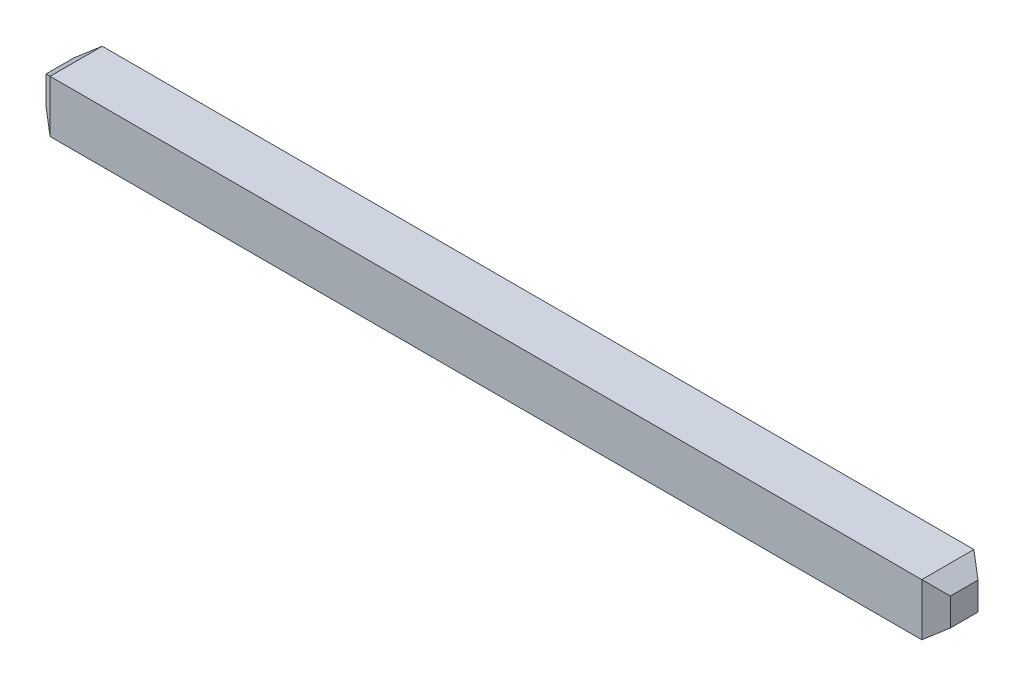
ISO-10303-21;
HEADER;
FILE_DESCRIPTION(('STEP AP214'),'2;1');
FILE_NAME('part.step','',(''),(''),'','','');
FILE_SCHEMA(('AUTOMOTIVE_DESIGN { 1 0 10303 214 1 1 1 1 }'));
ENDSEC;
DATA;
#1=APPLICATION_CONTEXT('core data for automotive mechanical design processes');
#2=APPLICATION_PROTOCOL_DEFINITION('international standard','automotive_design',2000,#1);
#3=PRODUCT_CONTEXT('',#1,'mechanical');
#4=PRODUCT('Part','Part','',(#3));
#5=PRODUCT_RELATED_PRODUCT_CATEGORY('part','',(#4));
#6=PRODUCT_DEFINITION_FORMATION('','',#4);
#7=PRODUCT_DEFINITION_CONTEXT('part definition',#1,'design');
#8=PRODUCT_DEFINITION('design','',#6,#7);
#9=PRODUCT_DEFINITION_SHAPE('','',#8);
#10=(LENGTH_UNIT() NAMED_UNIT(*) SI_UNIT(.MILLI.,.METRE.));
#11=(NAMED_UNIT(*) PLANE_ANGLE_UNIT() SI_UNIT($,.RADIAN.));
#12=(NAMED_UNIT(*) SI_UNIT($,.STERADIAN.) SOLID_ANGLE_UNIT());
#13=UNCERTAINTY_MEASURE_WITH_UNIT(LENGTH_MEASURE(1.E-05),#10,'distance_accuracy_value','');
#14=(GEOMETRIC_REPRESENTATION_CONTEXT(3) GLOBAL_UNCERTAINTY_ASSIGNED_CONTEXT((#13)) GLOBAL_UNIT_ASSIGNED_CONTEXT((#10,
#11,#12)) REPRESENTATION_CONTEXT('',''));
#15=CARTESIAN_POINT('',(0.,0.,0.));
#16=DIRECTION('',(0.,0.,1.));
#17=DIRECTION('',(1.,0.,0.));
#18=AXIS2_PLACEMENT_3D('',#15,#16,#17);
#19=CARTESIAN_POINT('',(-2.4,1.23,-1.515));
#20=DIRECTION('',(0.6,0.,0.8));
#21=DIRECTION('',(0.8,0.,-0.6));
#22=AXIS2_PLACEMENT_3D('',#19,#20,#21);
#23=PLANE('',#22);
#24=DIRECTION('',(0.,1.,0.));
#25=VECTOR('',#24,1.);
#26=CARTESIAN_POINT('',(-2.3,1.23,-1.59));
#27=LINE('',#26,#25);
#28=CARTESIAN_POINT('',(-2.3,1.55,-1.59));
#29=VERTEX_POINT('',#28);
#30=CARTESIAN_POINT('',(-2.30000000000001,0.909999999999898,-1.59));
#31=VERTEX_POINT('',#30);
#32=EDGE_CURVE('E101',#29,#31,#27,.F.);
#33=ORIENTED_EDGE('',*,*,#32,.T.);
#34=DIRECTION('',(-0.685994340569492,0.514495755428341,0.514495755427436));
#35=VECTOR('',#34,1.);
#36=CARTESIAN_POINT('',(-2.30000000000009,0.909999999999786,-1.59));
#37=LINE('',#36,#35);
#38=CARTESIAN_POINT('',(-2.49999999999999,1.06000000000001,-1.44));
#39=VERTEX_POINT('',#38);
#40=EDGE_CURVE('E85',#31,#39,#37,.T.);
#41=ORIENTED_EDGE('',*,*,#40,.T.);
#42=DIRECTION('',(0.,1.,0.));
#43=VECTOR('',#42,1.);
#44=CARTESIAN_POINT('',(-2.5,1.23,-1.44));
#45=LINE('',#44,#43);
#46=CARTESIAN_POINT('',(-2.5,1.4,-1.44));
#47=VERTEX_POINT('',#46);
#48=EDGE_CURVE('E79',#39,#47,#45,.T.);
#49=ORIENTED_EDGE('',*,*,#48,.T.);
#50=DIRECTION('',(-0.685994340570035,-0.514495755427527,0.514495755427527));
#51=VECTOR('',#50,1.);
#52=CARTESIAN_POINT('',(-2.3,1.55,-1.59));
#53=LINE('',#52,#51);
#54=EDGE_CURVE('E20',#29,#47,#53,.T.);
#55=ORIENTED_EDGE('',*,*,#54,.F.);
#56=EDGE_LOOP('',(#33,#41,#49,#55));
#57=FACE_BOUND('',#56,.T.);
#58=ADVANCED_FACE('F17',(#57),#23,.F.);
#59=CARTESIAN_POINT('',(8.5,1.23,-1.515));
#60=DIRECTION('',(-0.6,0.,0.8));
#61=DIRECTION('',(0.8,0.,0.6));
#62=AXIS2_PLACEMENT_3D('',#59,#60,#61);
#63=PLANE('',#62);
#64=DIRECTION('',(0.,1.,0.));
#65=VECTOR('',#64,1.);
#66=CARTESIAN_POINT('',(8.6,1.23,-1.44));
#67=LINE('',#66,#65);
#68=CARTESIAN_POINT('',(8.59999999999998,1.06000000000003,-1.44));
#69=VERTEX_POINT('',#68);
#70=CARTESIAN_POINT('',(8.6,1.4,-1.44));
#71=VERTEX_POINT('',#70);
#72=EDGE_CURVE('E113',#69,#71,#67,.T.);
#73=ORIENTED_EDGE('',*,*,#72,.F.);
#74=DIRECTION('',(-0.685994340569493,-0.514495755428341,-0.514495755427436));
#75=VECTOR('',#74,1.);
#76=CARTESIAN_POINT('',(8.59999999999996,1.06000000000005,-1.44));
#77=LINE('',#76,#75);
#78=CARTESIAN_POINT('',(8.40000000000002,0.909999999999884,-1.59));
#79=VERTEX_POINT('',#78);
#80=EDGE_CURVE('E108',#69,#79,#77,.T.);
#81=ORIENTED_EDGE('',*,*,#80,.T.);
#82=DIRECTION('',(0.,1.,0.));
#83=VECTOR('',#82,1.);
#84=CARTESIAN_POINT('',(8.4,1.23,-1.59));
#85=LINE('',#84,#83);
#86=CARTESIAN_POINT('',(8.4,1.55,-1.59));
#87=VERTEX_POINT('',#86);
#88=EDGE_CURVE('E99',#79,#87,#85,.T.);
#89=ORIENTED_EDGE('',*,*,#88,.T.);
#90=DIRECTION('',(-0.685994340570034,0.514495755427526,-0.514495755427529));
#91=VECTOR('',#90,1.);
#92=CARTESIAN_POINT('',(8.6,1.4,-1.44));
#93=LINE('',#92,#91);
#94=EDGE_CURVE('E116',#71,#87,#93,.T.);
#95=ORIENTED_EDGE('',*,*,#94,.F.);
#96=EDGE_LOOP('',(#73,#81,#89,#95));
#97=FACE_BOUND('',#96,.T.);
#98=ADVANCED_FACE('F214',(#97),#63,.F.);
#99=CARTESIAN_POINT('',(-2.4,1.475,-1.27));
#100=DIRECTION('',(-0.6,0.8,0.));
#101=DIRECTION('',(-0.8,-0.6,0.));
#102=AXIS2_PLACEMENT_3D('',#99,#100,#101);
#103=PLANE('',#102);
#104=DIRECTION('',(-0.685994340569492,-0.514495755427436,-0.514495755428341));
#105=VECTOR('',#104,1.);
#106=CARTESIAN_POINT('',(-2.30000000000004,1.55,-0.94999999999985));
#107=LINE('',#106,#105);
#108=CARTESIAN_POINT('',(-2.3,1.55,-0.949999999999906));
#109=VERTEX_POINT('',#108);
#110=CARTESIAN_POINT('',(-2.49999999999998,1.4,-1.10000000000003));
#111=VERTEX_POINT('',#110);
#112=EDGE_CURVE('E128',#109,#111,#107,.T.);
#113=ORIENTED_EDGE('',*,*,#112,.F.);
#114=DIRECTION('',(0.,0.,1.));
#115=VECTOR('',#114,1.);
#116=CARTESIAN_POINT('',(-2.3,1.55,-1.27));
#117=LINE('',#116,#115);
#118=EDGE_CURVE('E93',#29,#109,#117,.T.);
#119=ORIENTED_EDGE('',*,*,#118,.F.);
#120=ORIENTED_EDGE('',*,*,#54,.T.);
#121=DIRECTION('',(0.,0.,-1.));
#122=VECTOR('',#121,1.);
#123=CARTESIAN_POINT('',(-2.5,1.4,-1.27));
#124=LINE('',#123,#122);
#125=EDGE_CURVE('E87',#47,#111,#124,.F.);
#126=ORIENTED_EDGE('',*,*,#125,.T.);
#127=EDGE_LOOP('',(#113,#119,#120,#126));
#128=FACE_BOUND('',#127,.T.);
#129=ADVANCED_FACE('F90',(#128),#103,.T.);
#130=CARTESIAN_POINT('',(-2.5,1.23,-1.27));
#131=DIRECTION('',(1.,0.,0.));
#132=DIRECTION('',(0.,0.,-1.));
#133=AXIS2_PLACEMENT_3D('',#130,#131,#132);
#134=PLANE('',#133);
#135=DIRECTION('',(0.,1.,0.));
#136=VECTOR('',#135,1.);
#137=CARTESIAN_POINT('',(-2.49999999999991,1.23,-1.10000000000011));
#138=LINE('',#137,#136);
#139=CARTESIAN_POINT('',(-2.49999999999997,1.06000000000001,-1.10000000000003));
#140=VERTEX_POINT('',#139);
#141=EDGE_CURVE('E97',#111,#140,#138,.F.);
#142=ORIENTED_EDGE('',*,*,#141,.F.);
#143=ORIENTED_EDGE('',*,*,#125,.F.);
#144=ORIENTED_EDGE('',*,*,#48,.F.);
#145=DIRECTION('',(0.,0.,1.));
#146=VECTOR('',#145,1.);
#147=CARTESIAN_POINT('',(-2.49999999999996,1.06000000000005,-1.27));
#148=LINE('',#147,#146);
#149=EDGE_CURVE('E105',#39,#140,#148,.T.);
#150=ORIENTED_EDGE('',*,*,#149,.T.);
#151=EDGE_LOOP('',(#142,#143,#144,#150));
#152=FACE_BOUND('',#151,.T.);
#153=ADVANCED_FACE('F95',(#152),#134,.F.);
#154=CARTESIAN_POINT('',(3.05,1.23,-1.59));
#155=DIRECTION('',(0.,0.,1.));
#156=DIRECTION('',(1.,0.,0.));
#157=AXIS2_PLACEMENT_3D('',#154,#155,#156);
#158=PLANE('',#157);
#159=ORIENTED_EDGE('',*,*,#32,.F.);
#160=DIRECTION('',(1.,0.,0.));
#161=VECTOR('',#160,1.);
#162=CARTESIAN_POINT('',(3.05,1.55,-1.59));
#163=LINE('',#162,#161);
#164=EDGE_CURVE('E122',#87,#29,#163,.F.);
#165=ORIENTED_EDGE('',*,*,#164,.F.);
#166=ORIENTED_EDGE('',*,*,#88,.F.);
#167=DIRECTION('',(1.,0.,0.));
#168=VECTOR('',#167,1.);
#169=CARTESIAN_POINT('',(3.05,0.91,-1.59));
#170=LINE('',#169,#168);
#171=EDGE_CURVE('E136',#79,#31,#170,.F.);
#172=ORIENTED_EDGE('',*,*,#171,.T.);
#173=EDGE_LOOP('',(#159,#165,#166,#172));
#174=FACE_BOUND('',#173,.T.);
#175=ADVANCED_FACE('F182',(#174),#158,.F.);
#176=CARTESIAN_POINT('',(-2.4,0.9849999999999,-1.27));
#177=DIRECTION('',(0.600000000000912,0.799999999999316,0.));
#178=DIRECTION('',(-0.799999999999316,0.600000000000912,0.));
#179=AXIS2_PLACEMENT_3D('',#176,#177,#178);
#180=PLANE('',#179);
#181=DIRECTION('',(0.,0.,1.));
#182=VECTOR('',#181,1.);
#183=CARTESIAN_POINT('',(-2.3,0.91,-1.27));
#184=LINE('',#183,#182);
#185=CARTESIAN_POINT('',(-2.30000000000005,0.909999999999856,-0.9499999999999));
#186=VERTEX_POINT('',#185);
#187=EDGE_CURVE('E139',#31,#186,#184,.T.);
#188=ORIENTED_EDGE('',*,*,#187,.T.);
#189=DIRECTION('',(0.685994340569371,-0.514495755427688,0.51449575542825));
#190=VECTOR('',#189,1.);
#191=CARTESIAN_POINT('',(-2.49999999999991,1.06,-1.10000000000011));
#192=LINE('',#191,#190);
#193=EDGE_CURVE('E131',#140,#186,#192,.T.);
#194=ORIENTED_EDGE('',*,*,#193,.F.);
#195=ORIENTED_EDGE('',*,*,#149,.F.);
#196=ORIENTED_EDGE('',*,*,#40,.F.);
#197=EDGE_LOOP('',(#188,#194,#195,#196));
#198=FACE_BOUND('',#197,.T.);
#199=ADVANCED_FACE('F179',(#198),#180,.F.);
#200=CARTESIAN_POINT('',(8.5,0.9849999999999,-1.27));
#201=DIRECTION('',(-0.600000000000912,0.799999999999316,0.));
#202=DIRECTION('',(-0.799999999999316,-0.600000000000912,0.));
#203=AXIS2_PLACEMENT_3D('',#200,#201,#202);
#204=PLANE('',#203);
#205=DIRECTION('',(0.,0.,-1.));
#206=VECTOR('',#205,1.);
#207=CARTESIAN_POINT('',(8.6,1.06,-1.27));
#208=LINE('',#207,#206);
#209=CARTESIAN_POINT('',(8.59999999999996,1.06000000000003,-1.10000000000003));
#210=VERTEX_POINT('',#209);
#211=EDGE_CURVE('E110',#210,#69,#208,.T.);
#212=ORIENTED_EDGE('',*,*,#211,.F.);
#213=DIRECTION('',(0.68599434056937,0.514495755427691,-0.51449575542825));
#214=VECTOR('',#213,1.);
#215=CARTESIAN_POINT('',(8.40000000000004,0.9099999999999,-0.949999999999851));
#216=LINE('',#215,#214);
#217=CARTESIAN_POINT('',(8.40000000000005,0.909999999999868,-0.949999999999906));
#218=VERTEX_POINT('',#217);
#219=EDGE_CURVE('E35',#218,#210,#216,.T.);
#220=ORIENTED_EDGE('',*,*,#219,.F.);
#221=DIRECTION('',(0.,0.,1.));
#222=VECTOR('',#221,1.);
#223=CARTESIAN_POINT('',(8.4,0.91,-1.27));
#224=LINE('',#223,#222);
#225=EDGE_CURVE('E134',#218,#79,#224,.F.);
#226=ORIENTED_EDGE('',*,*,#225,.T.);
#227=ORIENTED_EDGE('',*,*,#80,.F.);
#228=EDGE_LOOP('',(#212,#220,#226,#227));
#229=FACE_BOUND('',#228,.T.);
#230=ADVANCED_FACE('F181',(#229),#204,.F.);
#231=CARTESIAN_POINT('',(8.6,1.23,-1.27));
#232=DIRECTION('',(1.,0.,0.));
#233=DIRECTION('',(0.,0.,-1.));
#234=AXIS2_PLACEMENT_3D('',#231,#232,#233);
#235=PLANE('',#234);
#236=ORIENTED_EDGE('',*,*,#72,.T.);
#237=DIRECTION('',(0.,0.,1.));
#238=VECTOR('',#237,1.);
#239=CARTESIAN_POINT('',(8.6,1.4,-1.27));
#240=LINE('',#239,#238);
#241=CARTESIAN_POINT('',(8.59999999999998,1.4,-1.10000000000003));
#242=VERTEX_POINT('',#241);
#243=EDGE_CURVE('E119',#242,#71,#240,.F.);
#244=ORIENTED_EDGE('',*,*,#243,.F.);
#245=DIRECTION('',(0.,1.,0.));
#246=VECTOR('',#245,1.);
#247=CARTESIAN_POINT('',(8.59999999999991,1.23,-1.10000000000011));
#248=LINE('',#247,#246);
#249=EDGE_CURVE('E142',#210,#242,#248,.T.);
#250=ORIENTED_EDGE('',*,*,#249,.F.);
#251=ORIENTED_EDGE('',*,*,#211,.T.);
#252=EDGE_LOOP('',(#236,#244,#250,#251));
#253=FACE_BOUND('',#252,.T.);
#254=ADVANCED_FACE('F189',(#253),#235,.T.);
#255=CARTESIAN_POINT('',(8.5,1.475,-1.27));
#256=DIRECTION('',(0.6,0.8,0.));
#257=DIRECTION('',(-0.8,0.6,0.));
#258=AXIS2_PLACEMENT_3D('',#255,#256,#257);
#259=PLANE('',#258);
#260=DIRECTION('',(-0.685994340569491,0.514495755427439,0.51449575542834));
#261=VECTOR('',#260,1.);
#262=CARTESIAN_POINT('',(8.59999999999991,1.4,-1.10000000000011));
#263=LINE('',#262,#261);
#264=CARTESIAN_POINT('',(8.40000000000001,1.55,-0.949999999999906));
#265=VERTEX_POINT('',#264);
#266=EDGE_CURVE('E145',#242,#265,#263,.T.);
#267=ORIENTED_EDGE('',*,*,#266,.F.);
#268=ORIENTED_EDGE('',*,*,#243,.T.);
#269=ORIENTED_EDGE('',*,*,#94,.T.);
#270=DIRECTION('',(0.,0.,1.));
#271=VECTOR('',#270,1.);
#272=CARTESIAN_POINT('',(8.4,1.55,-1.27));
#273=LINE('',#272,#271);
#274=EDGE_CURVE('E125',#265,#87,#273,.F.);
#275=ORIENTED_EDGE('',*,*,#274,.F.);
#276=EDGE_LOOP('',(#267,#268,#269,#275));
#277=FACE_BOUND('',#276,.T.);
#278=ADVANCED_FACE('F170',(#277),#259,.T.);
#279=CARTESIAN_POINT('',(3.05,1.55,-1.27));
#280=DIRECTION('',(0.,1.,0.));
#281=DIRECTION('',(0.,0.,1.));
#282=AXIS2_PLACEMENT_3D('',#279,#280,#281);
#283=PLANE('',#282);
#284=DIRECTION('',(1.,0.,0.));
#285=VECTOR('',#284,1.);
#286=CARTESIAN_POINT('',(3.05,1.55,-0.95));
#287=LINE('',#286,#285);
#288=EDGE_CURVE('E148',#265,#109,#287,.F.);
#289=ORIENTED_EDGE('',*,*,#288,.F.);
#290=ORIENTED_EDGE('',*,*,#274,.T.);
#291=ORIENTED_EDGE('',*,*,#164,.T.);
#292=ORIENTED_EDGE('',*,*,#118,.T.);
#293=EDGE_LOOP('',(#289,#290,#291,#292));
#294=FACE_BOUND('',#293,.T.);
#295=ADVANCED_FACE('F173',(#294),#283,.T.);
#296=CARTESIAN_POINT('',(-2.4,1.23,-1.025));
#297=DIRECTION('',(-0.600000000000912,0.,0.799999999999316));
#298=DIRECTION('',(0.799999999999316,0.,0.600000000000912));
#299=AXIS2_PLACEMENT_3D('',#296,#297,#298);
#300=PLANE('',#299);
#301=ORIENTED_EDGE('',*,*,#193,.T.);
#302=DIRECTION('',(0.,1.,0.));
#303=VECTOR('',#302,1.);
#304=CARTESIAN_POINT('',(-2.3,1.23,-0.95));
#305=LINE('',#304,#303);
#306=EDGE_CURVE('E151',#109,#186,#305,.F.);
#307=ORIENTED_EDGE('',*,*,#306,.F.);
#308=ORIENTED_EDGE('',*,*,#112,.T.);
#309=ORIENTED_EDGE('',*,*,#141,.T.);
#310=EDGE_LOOP('',(#301,#307,#308,#309));
#311=FACE_BOUND('',#310,.T.);
#312=ADVANCED_FACE('F176',(#311),#300,.T.);
#313=CARTESIAN_POINT('',(3.05,0.91,-1.27));
#314=DIRECTION('',(0.,1.,0.));
#315=DIRECTION('',(0.,0.,1.));
#316=AXIS2_PLACEMENT_3D('',#313,#314,#315);
#317=PLANE('',#316);
#318=ORIENTED_EDGE('',*,*,#187,.F.);
#319=ORIENTED_EDGE('',*,*,#171,.F.);
#320=ORIENTED_EDGE('',*,*,#225,.F.);
#321=DIRECTION('',(1.,0.,0.));
#322=VECTOR('',#321,1.);
#323=CARTESIAN_POINT('',(3.05,0.9099999999999,-0.95));
#324=LINE('',#323,#322);
#325=EDGE_CURVE('E26',#186,#218,#324,.T.);
#326=ORIENTED_EDGE('',*,*,#325,.F.);
#327=EDGE_LOOP('',(#318,#319,#320,#326));
#328=FACE_BOUND('',#327,.T.);
#329=ADVANCED_FACE('F162',(#328),#317,.F.);
#330=CARTESIAN_POINT('',(8.5,1.23,-1.025));
#331=DIRECTION('',(0.600000000000912,0.,0.799999999999316));
#332=DIRECTION('',(0.799999999999316,0.,-0.600000000000912));
#333=AXIS2_PLACEMENT_3D('',#330,#331,#332);
#334=PLANE('',#333);
#335=ORIENTED_EDGE('',*,*,#266,.T.);
#336=DIRECTION('',(0.,1.,0.));
#337=VECTOR('',#336,1.);
#338=CARTESIAN_POINT('',(8.4,1.23,-0.95));
#339=LINE('',#338,#337);
#340=EDGE_CURVE('E11',#218,#265,#339,.T.);
#341=ORIENTED_EDGE('',*,*,#340,.F.);
#342=ORIENTED_EDGE('',*,*,#219,.T.);
#343=ORIENTED_EDGE('',*,*,#249,.T.);
#344=EDGE_LOOP('',(#335,#341,#342,#343));
#345=FACE_BOUND('',#344,.T.);
#346=ADVANCED_FACE('F166',(#345),#334,.T.);
#347=CARTESIAN_POINT('',(3.05,1.23,-0.95));
#348=DIRECTION('',(0.,0.,1.));
#349=DIRECTION('',(1.,0.,0.));
#350=AXIS2_PLACEMENT_3D('',#347,#348,#349);
#351=PLANE('',#350);
#352=ORIENTED_EDGE('',*,*,#325,.T.);
#353=ORIENTED_EDGE('',*,*,#340,.T.);
#354=ORIENTED_EDGE('',*,*,#288,.T.);
#355=ORIENTED_EDGE('',*,*,#306,.T.);
#356=EDGE_LOOP('',(#352,#353,#354,#355));
#357=FACE_BOUND('',#356,.T.);
#358=ADVANCED_FACE('F157',(#357),#351,.T.);
#359=CLOSED_SHELL('',(#58,#98,#129,#153,#175,#199,#230,#254,#278,#295,#312,#329,#346,#358));
#360=MANIFOLD_SOLID_BREP('B1',#359);
#361=ADVANCED_BREP_SHAPE_REPRESENTATION('',(#18,#360),#14);
#362=SHAPE_DEFINITION_REPRESENTATION(#9,#361);
ENDSEC;
END-ISO-10303-21;
